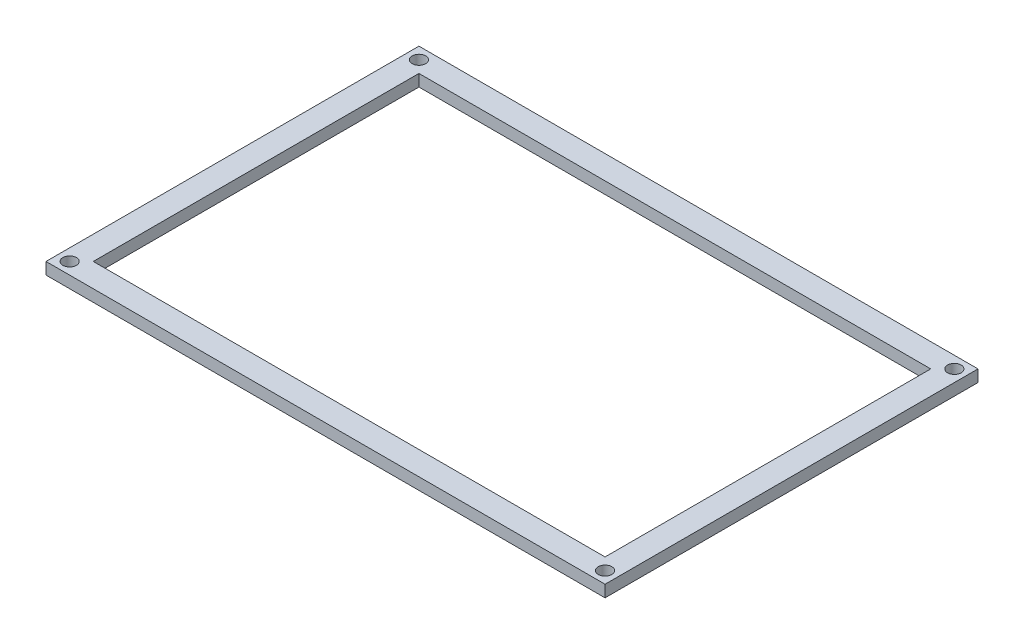
ISO-10303-21;
HEADER;
FILE_DESCRIPTION(('STEP AP214'),'2;1');
FILE_NAME('part.step','',(''),(''),'','','');
FILE_SCHEMA(('AUTOMOTIVE_DESIGN { 1 0 10303 214 1 1 1 1 }'));
ENDSEC;
DATA;
#1=APPLICATION_CONTEXT('core data for automotive mechanical design processes');
#2=APPLICATION_PROTOCOL_DEFINITION('international standard','automotive_design',2000,#1);
#3=PRODUCT_CONTEXT('',#1,'mechanical');
#4=PRODUCT('Part','Part','',(#3));
#5=PRODUCT_RELATED_PRODUCT_CATEGORY('part','',(#4));
#6=PRODUCT_DEFINITION_FORMATION('','',#4);
#7=PRODUCT_DEFINITION_CONTEXT('part definition',#1,'design');
#8=PRODUCT_DEFINITION('design','',#6,#7);
#9=PRODUCT_DEFINITION_SHAPE('','',#8);
#10=(LENGTH_UNIT() NAMED_UNIT(*) SI_UNIT(.MILLI.,.METRE.));
#11=(NAMED_UNIT(*) PLANE_ANGLE_UNIT() SI_UNIT($,.RADIAN.));
#12=(NAMED_UNIT(*) SI_UNIT($,.STERADIAN.) SOLID_ANGLE_UNIT());
#13=UNCERTAINTY_MEASURE_WITH_UNIT(LENGTH_MEASURE(1.E-05),#10,'distance_accuracy_value','');
#14=(GEOMETRIC_REPRESENTATION_CONTEXT(3) GLOBAL_UNCERTAINTY_ASSIGNED_CONTEXT((#13)) GLOBAL_UNIT_ASSIGNED_CONTEXT((#10,
#11,#12)) REPRESENTATION_CONTEXT('',''));
#15=CARTESIAN_POINT('',(0.,0.,0.));
#16=DIRECTION('',(0.,0.,1.));
#17=DIRECTION('',(1.,0.,0.));
#18=AXIS2_PLACEMENT_3D('',#15,#16,#17);
#19=CARTESIAN_POINT('',(0.,2.54,0.));
#20=DIRECTION('',(0.,-1.,0.));
#21=DIRECTION('',(0.,0.,-1.));
#22=AXIS2_PLACEMENT_3D('',#19,#20,#21);
#23=PLANE('',#22);
#24=CARTESIAN_POINT('',(-57.540017,2.54,37.540057));
#25=DIRECTION('',(0.,1.,0.));
#26=DIRECTION('',(0.,0.,-1.));
#27=AXIS2_PLACEMENT_3D('',#24,#25,#26);
#28=CIRCLE('',#27,1.4605);
#29=CARTESIAN_POINT('',(-57.540017,2.54,36.079557));
#30=VERTEX_POINT('',#29);
#31=EDGE_CURVE('E289',#30,#30,#28,.T.);
#32=ORIENTED_EDGE('',*,*,#31,.F.);
#33=EDGE_LOOP('',(#32));
#34=FACE_BOUND('',#33,.T.);
#35=CARTESIAN_POINT('',(-57.540017,2.54,-37.540057));
#36=DIRECTION('',(0.,1.,0.));
#37=DIRECTION('',(0.,0.,1.));
#38=AXIS2_PLACEMENT_3D('',#35,#36,#37);
#39=CIRCLE('',#38,1.4605);
#40=CARTESIAN_POINT('',(-57.540017,2.54,-36.079557));
#41=VERTEX_POINT('',#40);
#42=EDGE_CURVE('E279',#41,#41,#39,.T.);
#43=ORIENTED_EDGE('',*,*,#42,.F.);
#44=EDGE_LOOP('',(#43));
#45=FACE_BOUND('',#44,.T.);
#46=CARTESIAN_POINT('',(57.540017,2.54,-37.540057));
#47=DIRECTION('',(0.,1.,0.));
#48=DIRECTION('',(0.,0.,-1.));
#49=AXIS2_PLACEMENT_3D('',#46,#47,#48);
#50=CIRCLE('',#49,1.4605);
#51=CARTESIAN_POINT('',(57.540017,2.54,-39.000557));
#52=VERTEX_POINT('',#51);
#53=EDGE_CURVE('E269',#52,#52,#50,.T.);
#54=ORIENTED_EDGE('',*,*,#53,.F.);
#55=EDGE_LOOP('',(#54));
#56=FACE_BOUND('',#55,.T.);
#57=CARTESIAN_POINT('',(57.540017,2.54,37.540057));
#58=DIRECTION('',(0.,1.,0.));
#59=DIRECTION('',(0.,0.,1.));
#60=AXIS2_PLACEMENT_3D('',#57,#58,#59);
#61=CIRCLE('',#60,1.4605);
#62=CARTESIAN_POINT('',(57.540017,2.54,39.000557));
#63=VERTEX_POINT('',#62);
#64=EDGE_CURVE('E276',#63,#63,#61,.T.);
#65=ORIENTED_EDGE('',*,*,#64,.F.);
#66=EDGE_LOOP('',(#65));
#67=FACE_BOUND('',#66,.T.);
#68=DIRECTION('',(0.,0.,1.));
#69=VECTOR('',#68,1.);
#70=CARTESIAN_POINT('',(-60.080017,2.54,40.080057));
#71=LINE('',#70,#69);
#72=CARTESIAN_POINT('',(-60.080017,2.54,-40.080057));
#73=VERTEX_POINT('',#72);
#74=CARTESIAN_POINT('',(-60.080017,2.54,40.080057));
#75=VERTEX_POINT('',#74);
#76=EDGE_CURVE('E155',#73,#75,#71,.T.);
#77=ORIENTED_EDGE('',*,*,#76,.T.);
#78=DIRECTION('',(1.,0.,0.));
#79=VECTOR('',#78,1.);
#80=CARTESIAN_POINT('',(-60.080017,2.54,40.080057));
#81=LINE('',#80,#79);
#82=CARTESIAN_POINT('',(60.080017,2.54,40.080057));
#83=VERTEX_POINT('',#82);
#84=EDGE_CURVE('E159',#75,#83,#81,.T.);
#85=ORIENTED_EDGE('',*,*,#84,.T.);
#86=DIRECTION('',(0.,0.,-1.));
#87=VECTOR('',#86,1.);
#88=CARTESIAN_POINT('',(60.080017,2.54,40.080057));
#89=LINE('',#88,#87);
#90=CARTESIAN_POINT('',(60.080017,2.54,-40.080057));
#91=VERTEX_POINT('',#90);
#92=EDGE_CURVE('E163',#83,#91,#89,.T.);
#93=ORIENTED_EDGE('',*,*,#92,.T.);
#94=DIRECTION('',(-1.,0.,0.));
#95=VECTOR('',#94,1.);
#96=CARTESIAN_POINT('',(-60.080017,2.54,-40.080057));
#97=LINE('',#96,#95);
#98=EDGE_CURVE('E166',#91,#73,#97,.T.);
#99=ORIENTED_EDGE('',*,*,#98,.T.);
#100=EDGE_LOOP('',(#77,#85,#93,#99));
#101=FACE_BOUND('',#100,.T.);
#102=DIRECTION('',(0.,0.,-1.));
#103=VECTOR('',#102,1.);
#104=CARTESIAN_POINT('',(55.000017,2.54,35.000057));
#105=LINE('',#104,#103);
#106=CARTESIAN_POINT('',(55.000017,2.54,35.000057));
#107=VERTEX_POINT('',#106);
#108=CARTESIAN_POINT('',(55.000017,2.54,-35.000057));
#109=VERTEX_POINT('',#108);
#110=EDGE_CURVE('E105',#107,#109,#105,.T.);
#111=ORIENTED_EDGE('',*,*,#110,.F.);
#112=DIRECTION('',(1.,0.,0.));
#113=VECTOR('',#112,1.);
#114=CARTESIAN_POINT('',(-55.000017,2.54,35.000057));
#115=LINE('',#114,#113);
#116=CARTESIAN_POINT('',(-55.000017,2.54,35.000057));
#117=VERTEX_POINT('',#116);
#118=EDGE_CURVE('E131',#117,#107,#115,.T.);
#119=ORIENTED_EDGE('',*,*,#118,.F.);
#120=DIRECTION('',(0.,0.,1.));
#121=VECTOR('',#120,1.);
#122=CARTESIAN_POINT('',(-55.000017,2.54,35.000057));
#123=LINE('',#122,#121);
#124=CARTESIAN_POINT('',(-55.000017,2.54,-35.000057));
#125=VERTEX_POINT('',#124);
#126=EDGE_CURVE('E127',#125,#117,#123,.T.);
#127=ORIENTED_EDGE('',*,*,#126,.F.);
#128=DIRECTION('',(-1.,0.,0.));
#129=VECTOR('',#128,1.);
#130=CARTESIAN_POINT('',(-55.000017,2.54,-35.000057));
#131=LINE('',#130,#129);
#132=EDGE_CURVE('E114',#109,#125,#131,.T.);
#133=ORIENTED_EDGE('',*,*,#132,.F.);
#134=EDGE_LOOP('',(#111,#119,#127,#133));
#135=FACE_BOUND('',#134,.T.);
#136=ADVANCED_FACE('F39',(#34,#45,#56,#67,#101,#135),#23,.F.);
#137=CARTESIAN_POINT('',(0.,0.,0.));
#138=DIRECTION('',(0.,-1.,0.));
#139=DIRECTION('',(0.,0.,-1.));
#140=AXIS2_PLACEMENT_3D('',#137,#138,#139);
#141=PLANE('',#140);
#142=CARTESIAN_POINT('',(-57.540017,0.,37.540057));
#143=DIRECTION('',(0.,1.,0.));
#144=DIRECTION('',(0.,0.,-1.));
#145=AXIS2_PLACEMENT_3D('',#142,#143,#144);
#146=CIRCLE('',#145,1.4605);
#147=CARTESIAN_POINT('',(-57.540017,0.,36.079557));
#148=VERTEX_POINT('',#147);
#149=EDGE_CURVE('E285',#148,#148,#146,.T.);
#150=ORIENTED_EDGE('',*,*,#149,.T.);
#151=EDGE_LOOP('',(#150));
#152=FACE_BOUND('',#151,.T.);
#153=CARTESIAN_POINT('',(-57.540017,0.,-37.540057));
#154=DIRECTION('',(0.,1.,0.));
#155=DIRECTION('',(0.,0.,1.));
#156=AXIS2_PLACEMENT_3D('',#153,#154,#155);
#157=CIRCLE('',#156,1.4605);
#158=CARTESIAN_POINT('',(-57.540017,0.,-36.079557));
#159=VERTEX_POINT('',#158);
#160=EDGE_CURVE('E272',#159,#159,#157,.T.);
#161=ORIENTED_EDGE('',*,*,#160,.T.);
#162=EDGE_LOOP('',(#161));
#163=FACE_BOUND('',#162,.T.);
#164=CARTESIAN_POINT('',(57.540017,0.,-37.540057));
#165=DIRECTION('',(0.,1.,0.));
#166=DIRECTION('',(0.,0.,-1.));
#167=AXIS2_PLACEMENT_3D('',#164,#165,#166);
#168=CIRCLE('',#167,1.4605);
#169=CARTESIAN_POINT('',(57.540017,0.,-39.000557));
#170=VERTEX_POINT('',#169);
#171=EDGE_CURVE('E266',#170,#170,#168,.T.);
#172=ORIENTED_EDGE('',*,*,#171,.T.);
#173=EDGE_LOOP('',(#172));
#174=FACE_BOUND('',#173,.T.);
#175=CARTESIAN_POINT('',(57.540017,0.,37.540057));
#176=DIRECTION('',(0.,1.,0.));
#177=DIRECTION('',(0.,0.,1.));
#178=AXIS2_PLACEMENT_3D('',#175,#176,#177);
#179=CIRCLE('',#178,1.4605);
#180=CARTESIAN_POINT('',(57.540017,0.,39.000557));
#181=VERTEX_POINT('',#180);
#182=EDGE_CURVE('E139',#181,#181,#179,.T.);
#183=ORIENTED_EDGE('',*,*,#182,.T.);
#184=EDGE_LOOP('',(#183));
#185=FACE_BOUND('',#184,.T.);
#186=DIRECTION('',(0.,0.,1.));
#187=VECTOR('',#186,1.);
#188=CARTESIAN_POINT('',(-60.080017,0.,40.080057));
#189=LINE('',#188,#187);
#190=CARTESIAN_POINT('',(-60.080017,0.,-40.080057));
#191=VERTEX_POINT('',#190);
#192=CARTESIAN_POINT('',(-60.080017,0.,40.080057));
#193=VERTEX_POINT('',#192);
#194=EDGE_CURVE('E123',#191,#193,#189,.T.);
#195=ORIENTED_EDGE('',*,*,#194,.F.);
#196=DIRECTION('',(-1.,0.,0.));
#197=VECTOR('',#196,1.);
#198=CARTESIAN_POINT('',(-60.080017,0.,-40.080057));
#199=LINE('',#198,#197);
#200=CARTESIAN_POINT('',(60.080017,0.,-40.080057));
#201=VERTEX_POINT('',#200);
#202=EDGE_CURVE('E160',#201,#191,#199,.T.);
#203=ORIENTED_EDGE('',*,*,#202,.F.);
#204=DIRECTION('',(0.,0.,-1.));
#205=VECTOR('',#204,1.);
#206=CARTESIAN_POINT('',(60.080017,0.,40.080057));
#207=LINE('',#206,#205);
#208=CARTESIAN_POINT('',(60.080017,0.,40.080057));
#209=VERTEX_POINT('',#208);
#210=EDGE_CURVE('E176',#209,#201,#207,.T.);
#211=ORIENTED_EDGE('',*,*,#210,.F.);
#212=DIRECTION('',(1.,0.,0.));
#213=VECTOR('',#212,1.);
#214=CARTESIAN_POINT('',(-60.080017,0.,40.080057));
#215=LINE('',#214,#213);
#216=EDGE_CURVE('E173',#193,#209,#215,.T.);
#217=ORIENTED_EDGE('',*,*,#216,.F.);
#218=EDGE_LOOP('',(#195,#203,#211,#217));
#219=FACE_BOUND('',#218,.T.);
#220=DIRECTION('',(1.,0.,0.));
#221=VECTOR('',#220,1.);
#222=CARTESIAN_POINT('',(-55.000017,0.,35.000057));
#223=LINE('',#222,#221);
#224=CARTESIAN_POINT('',(-55.000017,0.,35.000057));
#225=VERTEX_POINT('',#224);
#226=CARTESIAN_POINT('',(55.000017,0.,35.000057));
#227=VERTEX_POINT('',#226);
#228=EDGE_CURVE('E115',#225,#227,#223,.T.);
#229=ORIENTED_EDGE('',*,*,#228,.T.);
#230=DIRECTION('',(0.,0.,-1.));
#231=VECTOR('',#230,1.);
#232=CARTESIAN_POINT('',(55.000017,0.,35.000057));
#233=LINE('',#232,#231);
#234=CARTESIAN_POINT('',(55.000017,0.,-35.000057));
#235=VERTEX_POINT('',#234);
#236=EDGE_CURVE('E63',#227,#235,#233,.T.);
#237=ORIENTED_EDGE('',*,*,#236,.T.);
#238=DIRECTION('',(-1.,0.,0.));
#239=VECTOR('',#238,1.);
#240=CARTESIAN_POINT('',(-55.000017,0.,-35.000057));
#241=LINE('',#240,#239);
#242=CARTESIAN_POINT('',(-55.000017,0.,-35.000057));
#243=VERTEX_POINT('',#242);
#244=EDGE_CURVE('E121',#235,#243,#241,.T.);
#245=ORIENTED_EDGE('',*,*,#244,.T.);
#246=DIRECTION('',(0.,0.,1.));
#247=VECTOR('',#246,1.);
#248=CARTESIAN_POINT('',(-55.000017,0.,35.000057));
#249=LINE('',#248,#247);
#250=EDGE_CURVE('E142',#243,#225,#249,.T.);
#251=ORIENTED_EDGE('',*,*,#250,.T.);
#252=EDGE_LOOP('',(#229,#237,#245,#251));
#253=FACE_BOUND('',#252,.T.);
#254=ADVANCED_FACE('F199',(#152,#163,#174,#185,#219,#253),#141,.T.);
#255=CARTESIAN_POINT('',(-60.080017,2.54,40.080057));
#256=DIRECTION('',(1.,0.,0.));
#257=DIRECTION('',(0.,0.,-1.));
#258=AXIS2_PLACEMENT_3D('',#255,#256,#257);
#259=PLANE('',#258);
#260=ORIENTED_EDGE('',*,*,#194,.T.);
#261=DIRECTION('',(0.,-1.,0.));
#262=VECTOR('',#261,1.);
#263=CARTESIAN_POINT('',(-60.080017,2.54,40.080057));
#264=LINE('',#263,#262);
#265=EDGE_CURVE('E11',#75,#193,#264,.T.);
#266=ORIENTED_EDGE('',*,*,#265,.F.);
#267=ORIENTED_EDGE('',*,*,#76,.F.);
#268=DIRECTION('',(0.,-1.,0.));
#269=VECTOR('',#268,1.);
#270=CARTESIAN_POINT('',(-60.080017,2.54,-40.080057));
#271=LINE('',#270,#269);
#272=EDGE_CURVE('E169',#73,#191,#271,.T.);
#273=ORIENTED_EDGE('',*,*,#272,.T.);
#274=EDGE_LOOP('',(#260,#266,#267,#273));
#275=FACE_BOUND('',#274,.T.);
#276=ADVANCED_FACE('F41',(#275),#259,.F.);
#277=CARTESIAN_POINT('',(-60.080017,2.54,40.080057));
#278=DIRECTION('',(0.,0.,-1.));
#279=DIRECTION('',(-1.,0.,0.));
#280=AXIS2_PLACEMENT_3D('',#277,#278,#279);
#281=PLANE('',#280);
#282=ORIENTED_EDGE('',*,*,#216,.T.);
#283=DIRECTION('',(0.,-1.,0.));
#284=VECTOR('',#283,1.);
#285=CARTESIAN_POINT('',(60.080017,2.54,40.080057));
#286=LINE('',#285,#284);
#287=EDGE_CURVE('E48',#83,#209,#286,.T.);
#288=ORIENTED_EDGE('',*,*,#287,.F.);
#289=ORIENTED_EDGE('',*,*,#84,.F.);
#290=ORIENTED_EDGE('',*,*,#265,.T.);
#291=EDGE_LOOP('',(#282,#288,#289,#290));
#292=FACE_BOUND('',#291,.T.);
#293=ADVANCED_FACE('F209',(#292),#281,.F.);
#294=CARTESIAN_POINT('',(60.080017,2.54,40.080057));
#295=DIRECTION('',(-1.,0.,0.));
#296=DIRECTION('',(0.,0.,1.));
#297=AXIS2_PLACEMENT_3D('',#294,#295,#296);
#298=PLANE('',#297);
#299=ORIENTED_EDGE('',*,*,#210,.T.);
#300=DIRECTION('',(0.,-1.,0.));
#301=VECTOR('',#300,1.);
#302=CARTESIAN_POINT('',(60.080017,2.54,-40.080057));
#303=LINE('',#302,#301);
#304=EDGE_CURVE('E184',#91,#201,#303,.T.);
#305=ORIENTED_EDGE('',*,*,#304,.F.);
#306=ORIENTED_EDGE('',*,*,#92,.F.);
#307=ORIENTED_EDGE('',*,*,#287,.T.);
#308=EDGE_LOOP('',(#299,#305,#306,#307));
#309=FACE_BOUND('',#308,.T.);
#310=ADVANCED_FACE('F193',(#309),#298,.F.);
#311=CARTESIAN_POINT('',(-60.080017,2.54,-40.080057));
#312=DIRECTION('',(0.,0.,1.));
#313=DIRECTION('',(1.,0.,0.));
#314=AXIS2_PLACEMENT_3D('',#311,#312,#313);
#315=PLANE('',#314);
#316=ORIENTED_EDGE('',*,*,#202,.T.);
#317=ORIENTED_EDGE('',*,*,#272,.F.);
#318=ORIENTED_EDGE('',*,*,#98,.F.);
#319=ORIENTED_EDGE('',*,*,#304,.T.);
#320=EDGE_LOOP('',(#316,#317,#318,#319));
#321=FACE_BOUND('',#320,.T.);
#322=ADVANCED_FACE('F203',(#321),#315,.F.);
#323=CARTESIAN_POINT('',(55.000017,2.54,35.000057));
#324=DIRECTION('',(-1.,0.,0.));
#325=DIRECTION('',(0.,0.,1.));
#326=AXIS2_PLACEMENT_3D('',#323,#324,#325);
#327=PLANE('',#326);
#328=ORIENTED_EDGE('',*,*,#236,.F.);
#329=DIRECTION('',(0.,-1.,0.));
#330=VECTOR('',#329,1.);
#331=CARTESIAN_POINT('',(55.000017,2.54,35.000057));
#332=LINE('',#331,#330);
#333=EDGE_CURVE('E109',#107,#227,#332,.T.);
#334=ORIENTED_EDGE('',*,*,#333,.F.);
#335=ORIENTED_EDGE('',*,*,#110,.T.);
#336=DIRECTION('',(0.,-1.,0.));
#337=VECTOR('',#336,1.);
#338=CARTESIAN_POINT('',(55.000017,2.54,-35.000057));
#339=LINE('',#338,#337);
#340=EDGE_CURVE('E108',#109,#235,#339,.T.);
#341=ORIENTED_EDGE('',*,*,#340,.T.);
#342=EDGE_LOOP('',(#328,#334,#335,#341));
#343=FACE_BOUND('',#342,.T.);
#344=ADVANCED_FACE('F107',(#343),#327,.T.);
#345=CARTESIAN_POINT('',(-55.000017,2.54,-35.000057));
#346=DIRECTION('',(0.,0.,1.));
#347=DIRECTION('',(1.,0.,0.));
#348=AXIS2_PLACEMENT_3D('',#345,#346,#347);
#349=PLANE('',#348);
#350=ORIENTED_EDGE('',*,*,#244,.F.);
#351=ORIENTED_EDGE('',*,*,#340,.F.);
#352=ORIENTED_EDGE('',*,*,#132,.T.);
#353=DIRECTION('',(0.,-1.,0.));
#354=VECTOR('',#353,1.);
#355=CARTESIAN_POINT('',(-55.000017,2.54,-35.000057));
#356=LINE('',#355,#354);
#357=EDGE_CURVE('E124',#125,#243,#356,.T.);
#358=ORIENTED_EDGE('',*,*,#357,.T.);
#359=EDGE_LOOP('',(#350,#351,#352,#358));
#360=FACE_BOUND('',#359,.T.);
#361=ADVANCED_FACE('F118',(#360),#349,.T.);
#362=CARTESIAN_POINT('',(-55.000017,2.54,35.000057));
#363=DIRECTION('',(1.,0.,0.));
#364=DIRECTION('',(0.,0.,-1.));
#365=AXIS2_PLACEMENT_3D('',#362,#363,#364);
#366=PLANE('',#365);
#367=ORIENTED_EDGE('',*,*,#250,.F.);
#368=ORIENTED_EDGE('',*,*,#357,.F.);
#369=ORIENTED_EDGE('',*,*,#126,.T.);
#370=DIRECTION('',(0.,-1.,0.));
#371=VECTOR('',#370,1.);
#372=CARTESIAN_POINT('',(-55.000017,2.54,35.000057));
#373=LINE('',#372,#371);
#374=EDGE_CURVE('E55',#117,#225,#373,.T.);
#375=ORIENTED_EDGE('',*,*,#374,.T.);
#376=EDGE_LOOP('',(#367,#368,#369,#375));
#377=FACE_BOUND('',#376,.T.);
#378=ADVANCED_FACE('F236',(#377),#366,.T.);
#379=CARTESIAN_POINT('',(-55.000017,2.54,35.000057));
#380=DIRECTION('',(0.,0.,-1.));
#381=DIRECTION('',(-1.,0.,0.));
#382=AXIS2_PLACEMENT_3D('',#379,#380,#381);
#383=PLANE('',#382);
#384=ORIENTED_EDGE('',*,*,#228,.F.);
#385=ORIENTED_EDGE('',*,*,#374,.F.);
#386=ORIENTED_EDGE('',*,*,#118,.T.);
#387=ORIENTED_EDGE('',*,*,#333,.T.);
#388=EDGE_LOOP('',(#384,#385,#386,#387));
#389=FACE_BOUND('',#388,.T.);
#390=ADVANCED_FACE('F240',(#389),#383,.T.);
#391=CARTESIAN_POINT('',(57.540017,0.,37.540057));
#392=DIRECTION('',(0.,1.,0.));
#393=DIRECTION('',(0.,0.,1.));
#394=AXIS2_PLACEMENT_3D('',#391,#392,#393);
#395=CYLINDRICAL_SURFACE('',#394,1.4605);
#396=ORIENTED_EDGE('',*,*,#182,.F.);
#397=EDGE_LOOP('',(#396));
#398=FACE_BOUND('',#397,.T.);
#399=ORIENTED_EDGE('',*,*,#64,.T.);
#400=EDGE_LOOP('',(#399));
#401=FACE_BOUND('',#400,.T.);
#402=ADVANCED_FACE('F246',(#398,#401),#395,.F.);
#403=CARTESIAN_POINT('',(57.540017,0.,-37.540057));
#404=DIRECTION('',(0.,1.,0.));
#405=DIRECTION('',(0.,0.,1.));
#406=AXIS2_PLACEMENT_3D('',#403,#404,#405);
#407=CYLINDRICAL_SURFACE('',#406,1.4605);
#408=ORIENTED_EDGE('',*,*,#171,.F.);
#409=EDGE_LOOP('',(#408));
#410=FACE_BOUND('',#409,.T.);
#411=ORIENTED_EDGE('',*,*,#53,.T.);
#412=EDGE_LOOP('',(#411));
#413=FACE_BOUND('',#412,.T.);
#414=ADVANCED_FACE('F249',(#410,#413),#407,.F.);
#415=CARTESIAN_POINT('',(-57.540017,0.,-37.540057));
#416=DIRECTION('',(0.,1.,0.));
#417=DIRECTION('',(0.,0.,1.));
#418=AXIS2_PLACEMENT_3D('',#415,#416,#417);
#419=CYLINDRICAL_SURFACE('',#418,1.4605);
#420=ORIENTED_EDGE('',*,*,#160,.F.);
#421=EDGE_LOOP('',(#420));
#422=FACE_BOUND('',#421,.T.);
#423=ORIENTED_EDGE('',*,*,#42,.T.);
#424=EDGE_LOOP('',(#423));
#425=FACE_BOUND('',#424,.T.);
#426=ADVANCED_FACE('F254',(#422,#425),#419,.F.);
#427=CARTESIAN_POINT('',(-57.540017,0.,37.540057));
#428=DIRECTION('',(0.,1.,0.));
#429=DIRECTION('',(0.,0.,1.));
#430=AXIS2_PLACEMENT_3D('',#427,#428,#429);
#431=CYLINDRICAL_SURFACE('',#430,1.4605);
#432=ORIENTED_EDGE('',*,*,#149,.F.);
#433=EDGE_LOOP('',(#432));
#434=FACE_BOUND('',#433,.T.);
#435=ORIENTED_EDGE('',*,*,#31,.T.);
#436=EDGE_LOOP('',(#435));
#437=FACE_BOUND('',#436,.T.);
#438=ADVANCED_FACE('F251',(#434,#437),#431,.F.);
#439=CLOSED_SHELL('',(#136,#254,#276,#293,#310,#322,#344,#361,#378,#390,#402,#414,#426,#438));
#440=MANIFOLD_SOLID_BREP('B2',#439);
#441=ADVANCED_BREP_SHAPE_REPRESENTATION('',(#18,#440),#14);
#442=SHAPE_DEFINITION_REPRESENTATION(#9,#441);
ENDSEC;
END-ISO-10303-21;
